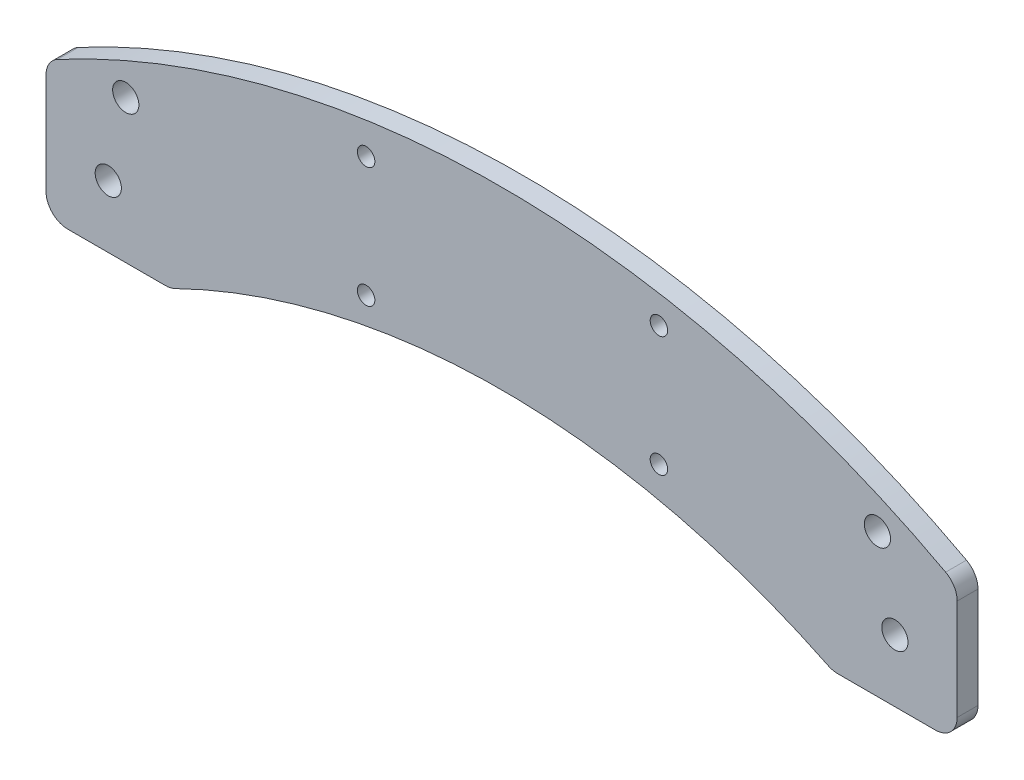
ISO-10303-21;
HEADER;
FILE_DESCRIPTION(('STEP AP214'),'2;1');
FILE_NAME('part.step','',(''),(''),'','','');
FILE_SCHEMA(('AUTOMOTIVE_DESIGN { 1 0 10303 214 1 1 1 1 }'));
ENDSEC;
DATA;
#1=APPLICATION_CONTEXT('core data for automotive mechanical design processes');
#2=APPLICATION_PROTOCOL_DEFINITION('international standard','automotive_design',2000,#1);
#3=PRODUCT_CONTEXT('',#1,'mechanical');
#4=PRODUCT('Part','Part','',(#3));
#5=PRODUCT_RELATED_PRODUCT_CATEGORY('part','',(#4));
#6=PRODUCT_DEFINITION_FORMATION('','',#4);
#7=PRODUCT_DEFINITION_CONTEXT('part definition',#1,'design');
#8=PRODUCT_DEFINITION('design','',#6,#7);
#9=PRODUCT_DEFINITION_SHAPE('','',#8);
#10=(LENGTH_UNIT() NAMED_UNIT(*) SI_UNIT(.MILLI.,.METRE.));
#11=(NAMED_UNIT(*) PLANE_ANGLE_UNIT() SI_UNIT($,.RADIAN.));
#12=(NAMED_UNIT(*) SI_UNIT($,.STERADIAN.) SOLID_ANGLE_UNIT());
#13=UNCERTAINTY_MEASURE_WITH_UNIT(LENGTH_MEASURE(1.E-05),#10,'distance_accuracy_value','');
#14=(GEOMETRIC_REPRESENTATION_CONTEXT(3) GLOBAL_UNCERTAINTY_ASSIGNED_CONTEXT((#13)) GLOBAL_UNIT_ASSIGNED_CONTEXT((#10,
#11,#12)) REPRESENTATION_CONTEXT('',''));
#15=CARTESIAN_POINT('',(0.,0.,0.));
#16=DIRECTION('',(0.,0.,1.));
#17=DIRECTION('',(1.,0.,0.));
#18=AXIS2_PLACEMENT_3D('',#15,#16,#17);
#19=CARTESIAN_POINT('',(-9.24999999999994,13.8160355116518,4.7625));
#20=DIRECTION('',(0.,0.,-1.));
#21=DIRECTION('',(-1.,0.,0.));
#22=AXIS2_PLACEMENT_3D('',#19,#20,#21);
#23=PLANE('',#22);
#24=CARTESIAN_POINT('',(4.00000000000005,18.5,4.7625));
#25=DIRECTION('',(0.,0.,1.));
#26=DIRECTION('',(1.,0.,0.));
#27=AXIS2_PLACEMENT_3D('',#24,#25,#26);
#28=CIRCLE('',#27,3.00000000000224);
#29=CARTESIAN_POINT('',(7.00000000000229,18.5,4.7625));
#30=VERTEX_POINT('',#29);
#31=EDGE_CURVE('E308',#30,#30,#28,.T.);
#32=ORIENTED_EDGE('',*,*,#31,.F.);
#33=EDGE_LOOP('',(#32));
#34=FACE_BOUND('',#33,.T.);
#35=CARTESIAN_POINT('',(180.,0.,4.7625));
#36=DIRECTION('',(0.,0.,1.));
#37=DIRECTION('',(1.,0.,0.));
#38=AXIS2_PLACEMENT_3D('',#35,#36,#37);
#39=CIRCLE('',#38,2.99999999999999);
#40=CARTESIAN_POINT('',(183.,0.,4.7625));
#41=VERTEX_POINT('',#40);
#42=EDGE_CURVE('E320',#41,#41,#39,.T.);
#43=ORIENTED_EDGE('',*,*,#42,.F.);
#44=EDGE_LOOP('',(#43));
#45=FACE_BOUND('',#44,.T.);
#46=CARTESIAN_POINT('',(125.999999999998,34.2904968261802,4.7625));
#47=DIRECTION('',(0.,0.,1.));
#48=DIRECTION('',(1.,0.,0.));
#49=AXIS2_PLACEMENT_3D('',#46,#47,#48);
#50=CIRCLE('',#49,2.);
#51=CARTESIAN_POINT('',(127.999999999998,34.2904968261802,4.7625));
#52=VERTEX_POINT('',#51);
#53=EDGE_CURVE('E332',#52,#52,#50,.T.);
#54=ORIENTED_EDGE('',*,*,#53,.F.);
#55=EDGE_LOOP('',(#54));
#56=FACE_BOUND('',#55,.T.);
#57=CARTESIAN_POINT('',(58.9999999999978,34.2904968261758,4.7625));
#58=DIRECTION('',(0.,0.,1.));
#59=DIRECTION('',(1.,0.,0.));
#60=AXIS2_PLACEMENT_3D('',#57,#58,#59);
#61=CIRCLE('',#60,1.99999999999999);
#62=CARTESIAN_POINT('',(60.9999999999977,34.2904968261758,4.7625));
#63=VERTEX_POINT('',#62);
#64=EDGE_CURVE('E158',#63,#63,#61,.T.);
#65=ORIENTED_EDGE('',*,*,#64,.F.);
#66=EDGE_LOOP('',(#65));
#67=FACE_BOUND('',#66,.T.);
#68=CARTESIAN_POINT('',(-9.24999999999994,13.8160355116518,4.7625));
#69=DIRECTION('',(0.,0.,1.));
#70=DIRECTION('',(-1.,0.,0.));
#71=AXIS2_PLACEMENT_3D('',#68,#69,#70);
#72=CIRCLE('',#71,5.);
#73=CARTESIAN_POINT('',(-11.6130952380952,18.2223696905007,4.7625));
#74=VERTEX_POINT('',#73);
#75=CARTESIAN_POINT('',(-14.2499999999999,13.8160355116518,4.7625));
#76=VERTEX_POINT('',#75);
#77=EDGE_CURVE('E177',#74,#76,#72,.T.);
#78=ORIENTED_EDGE('',*,*,#77,.T.);
#79=DIRECTION('',(1.20782173469353E-13,-1.,0.));
#80=VECTOR('',#79,1.);
#81=CARTESIAN_POINT('',(-14.2499999999972,-9.25000000000138,4.7625));
#82=LINE('',#81,#80);
#83=CARTESIAN_POINT('',(-14.2499999999972,-9.25000000000138,4.7625));
#84=VERTEX_POINT('',#83);
#85=EDGE_CURVE('E105',#76,#84,#82,.T.);
#86=ORIENTED_EDGE('',*,*,#85,.T.);
#87=CARTESIAN_POINT('',(-9.24999999999715,-9.25000000000141,4.7625));
#88=DIRECTION('',(0.,0.,1.));
#89=DIRECTION('',(1.,0.,0.));
#90=AXIS2_PLACEMENT_3D('',#87,#88,#89);
#91=CIRCLE('',#90,5.);
#92=CARTESIAN_POINT('',(-9.24999999999712,-14.2500000000014,4.7625));
#93=VERTEX_POINT('',#92);
#94=EDGE_CURVE('E204',#84,#93,#91,.T.);
#95=ORIENTED_EDGE('',*,*,#94,.T.);
#96=DIRECTION('',(1.,0.,0.));
#97=VECTOR('',#96,1.);
#98=CARTESIAN_POINT('',(13.0834357599211,-14.25,4.7625));
#99=LINE('',#98,#97);
#100=CARTESIAN_POINT('',(13.0834357599211,-14.25,4.7625));
#101=VERTEX_POINT('',#100);
#102=EDGE_CURVE('E223',#93,#101,#99,.T.);
#103=ORIENTED_EDGE('',*,*,#102,.T.);
#104=CARTESIAN_POINT('',(13.0834357599211,-9.24999999999995,4.7625));
#105=DIRECTION('',(0.,0.,1.));
#106=DIRECTION('',(-1.,0.,0.));
#107=AXIS2_PLACEMENT_3D('',#104,#105,#106);
#108=CIRCLE('',#107,4.99999999999999);
#109=CARTESIAN_POINT('',(15.2810518810662,-13.7411561300051,4.7625));
#110=VERTEX_POINT('',#109);
#111=EDGE_CURVE('E220',#101,#110,#108,.T.);
#112=ORIENTED_EDGE('',*,*,#111,.T.);
#113=CARTESIAN_POINT('',(90.0000000000002,-166.440464550181,4.7625));
#114=DIRECTION('',(0.,0.,-1.));
#115=DIRECTION('',(1.,0.,0.));
#116=AXIS2_PLACEMENT_3D('',#113,#114,#115);
#117=CIRCLE('',#116,170.);
#118=CARTESIAN_POINT('',(164.718948118934,-13.741156130005,4.7625));
#119=VERTEX_POINT('',#118);
#120=EDGE_CURVE('E222',#110,#119,#117,.T.);
#121=ORIENTED_EDGE('',*,*,#120,.T.);
#122=CARTESIAN_POINT('',(166.916564240079,-9.24999999999981,4.7625));
#123=DIRECTION('',(0.,0.,1.));
#124=DIRECTION('',(-1.,0.,0.));
#125=AXIS2_PLACEMENT_3D('',#122,#123,#124);
#126=CIRCLE('',#125,5.00000000000001);
#127=CARTESIAN_POINT('',(166.916564240079,-14.2499999999998,4.7625));
#128=VERTEX_POINT('',#127);
#129=EDGE_CURVE('E225',#119,#128,#126,.T.);
#130=ORIENTED_EDGE('',*,*,#129,.T.);
#131=DIRECTION('',(1.,0.,0.));
#132=VECTOR('',#131,1.);
#133=CARTESIAN_POINT('',(189.25,-14.25,4.7625));
#134=LINE('',#133,#132);
#135=CARTESIAN_POINT('',(189.25,-14.25,4.7625));
#136=VERTEX_POINT('',#135);
#137=EDGE_CURVE('E231',#128,#136,#134,.T.);
#138=ORIENTED_EDGE('',*,*,#137,.T.);
#139=CARTESIAN_POINT('',(189.25,-9.24999999999999,4.7625));
#140=DIRECTION('',(0.,0.,1.));
#141=DIRECTION('',(-1.,0.,0.));
#142=AXIS2_PLACEMENT_3D('',#139,#140,#141);
#143=CIRCLE('',#142,5.);
#144=CARTESIAN_POINT('',(194.25,-9.24999999999996,4.7625));
#145=VERTEX_POINT('',#144);
#146=EDGE_CURVE('E136',#136,#145,#143,.T.);
#147=ORIENTED_EDGE('',*,*,#146,.T.);
#148=DIRECTION('',(0.,1.,0.));
#149=VECTOR('',#148,1.);
#150=CARTESIAN_POINT('',(194.25,13.816035511652,4.7625));
#151=LINE('',#150,#149);
#152=CARTESIAN_POINT('',(194.25,13.816035511652,4.7625));
#153=VERTEX_POINT('',#152);
#154=EDGE_CURVE('E130',#145,#153,#151,.T.);
#155=ORIENTED_EDGE('',*,*,#154,.T.);
#156=CARTESIAN_POINT('',(189.25,13.816035511652,4.7625));
#157=DIRECTION('',(0.,0.,1.));
#158=DIRECTION('',(-1.,0.,0.));
#159=AXIS2_PLACEMENT_3D('',#156,#157,#158);
#160=CIRCLE('',#159,4.99999999999999);
#161=CARTESIAN_POINT('',(191.613095238095,18.2223696905009,4.7625));
#162=VERTEX_POINT('',#161);
#163=EDGE_CURVE('E134',#153,#162,#160,.T.);
#164=ORIENTED_EDGE('',*,*,#163,.T.);
#165=CARTESIAN_POINT('',(90.0000000000002,-171.25,4.7625));
#166=DIRECTION('',(0.,0.,1.));
#167=DIRECTION('',(-1.,0.,0.));
#168=AXIS2_PLACEMENT_3D('',#165,#166,#167);
#169=CIRCLE('',#168,215.);
#170=EDGE_CURVE('E50',#162,#74,#169,.T.);
#171=ORIENTED_EDGE('',*,*,#170,.T.);
#172=EDGE_LOOP('',(#78,#86,#95,#103,#112,#121,#130,#138,#147,#155,#164,#171));
#173=FACE_BOUND('',#172,.T.);
#174=CARTESIAN_POINT('',(58.9999999999996,6.79049682617575,4.7625));
#175=DIRECTION('',(0.,0.,1.));
#176=DIRECTION('',(1.,0.,0.));
#177=AXIS2_PLACEMENT_3D('',#174,#175,#176);
#178=CIRCLE('',#177,1.99999999999999);
#179=CARTESIAN_POINT('',(60.9999999999996,6.79049682617575,4.7625));
#180=VERTEX_POINT('',#179);
#181=EDGE_CURVE('E338',#180,#180,#178,.T.);
#182=ORIENTED_EDGE('',*,*,#181,.F.);
#183=EDGE_LOOP('',(#182));
#184=FACE_BOUND('',#183,.T.);
#185=CARTESIAN_POINT('',(126.,6.79049682618024,4.7625));
#186=DIRECTION('',(0.,0.,1.));
#187=DIRECTION('',(1.,0.,0.));
#188=AXIS2_PLACEMENT_3D('',#185,#186,#187);
#189=CIRCLE('',#188,2.);
#190=CARTESIAN_POINT('',(128.,6.79049682618024,4.7625));
#191=VERTEX_POINT('',#190);
#192=EDGE_CURVE('E326',#191,#191,#189,.T.);
#193=ORIENTED_EDGE('',*,*,#192,.F.);
#194=EDGE_LOOP('',(#193));
#195=FACE_BOUND('',#194,.T.);
#196=CARTESIAN_POINT('',(0.,0.,4.7625));
#197=DIRECTION('',(0.,0.,1.));
#198=DIRECTION('',(1.,0.,0.));
#199=AXIS2_PLACEMENT_3D('',#196,#197,#198);
#200=CIRCLE('',#199,3.);
#201=CARTESIAN_POINT('',(3.,0.,4.7625));
#202=VERTEX_POINT('',#201);
#203=EDGE_CURVE('E314',#202,#202,#200,.T.);
#204=ORIENTED_EDGE('',*,*,#203,.F.);
#205=EDGE_LOOP('',(#204));
#206=FACE_BOUND('',#205,.T.);
#207=CARTESIAN_POINT('',(176.,18.5000000000002,4.7625));
#208=DIRECTION('',(0.,0.,1.));
#209=DIRECTION('',(1.,0.,0.));
#210=AXIS2_PLACEMENT_3D('',#207,#208,#209);
#211=CIRCLE('',#210,2.99999999999999);
#212=CARTESIAN_POINT('',(179.,18.5000000000002,4.7625));
#213=VERTEX_POINT('',#212);
#214=EDGE_CURVE('E299',#213,#213,#211,.T.);
#215=ORIENTED_EDGE('',*,*,#214,.F.);
#216=EDGE_LOOP('',(#215));
#217=FACE_BOUND('',#216,.T.);
#218=ADVANCED_FACE('F33',(#34,#45,#56,#67,#173,#184,#195,#206,#217),#23,.F.);
#219=CARTESIAN_POINT('',(-9.24999999999994,13.8160355116518,0.));
#220=DIRECTION('',(0.,0.,-1.));
#221=DIRECTION('',(-1.,0.,0.));
#222=AXIS2_PLACEMENT_3D('',#219,#220,#221);
#223=PLANE('',#222);
#224=CARTESIAN_POINT('',(4.00000000000005,18.5,0.));
#225=DIRECTION('',(0.,0.,1.));
#226=DIRECTION('',(1.,0.,0.));
#227=AXIS2_PLACEMENT_3D('',#224,#225,#226);
#228=CIRCLE('',#227,3.00000000000224);
#229=CARTESIAN_POINT('',(7.00000000000229,18.5,0.));
#230=VERTEX_POINT('',#229);
#231=EDGE_CURVE('E305',#230,#230,#228,.T.);
#232=ORIENTED_EDGE('',*,*,#231,.T.);
#233=EDGE_LOOP('',(#232));
#234=FACE_BOUND('',#233,.T.);
#235=CARTESIAN_POINT('',(180.,0.,0.));
#236=DIRECTION('',(0.,0.,1.));
#237=DIRECTION('',(1.,0.,0.));
#238=AXIS2_PLACEMENT_3D('',#235,#236,#237);
#239=CIRCLE('',#238,2.99999999999999);
#240=CARTESIAN_POINT('',(183.,0.,0.));
#241=VERTEX_POINT('',#240);
#242=EDGE_CURVE('E317',#241,#241,#239,.T.);
#243=ORIENTED_EDGE('',*,*,#242,.T.);
#244=EDGE_LOOP('',(#243));
#245=FACE_BOUND('',#244,.T.);
#246=CARTESIAN_POINT('',(125.999999999998,34.2904968261802,0.));
#247=DIRECTION('',(0.,0.,1.));
#248=DIRECTION('',(1.,0.,0.));
#249=AXIS2_PLACEMENT_3D('',#246,#247,#248);
#250=CIRCLE('',#249,2.);
#251=CARTESIAN_POINT('',(127.999999999998,34.2904968261802,0.));
#252=VERTEX_POINT('',#251);
#253=EDGE_CURVE('E329',#252,#252,#250,.T.);
#254=ORIENTED_EDGE('',*,*,#253,.T.);
#255=EDGE_LOOP('',(#254));
#256=FACE_BOUND('',#255,.T.);
#257=CARTESIAN_POINT('',(58.9999999999978,34.2904968261758,0.));
#258=DIRECTION('',(0.,0.,1.));
#259=DIRECTION('',(1.,0.,0.));
#260=AXIS2_PLACEMENT_3D('',#257,#258,#259);
#261=CIRCLE('',#260,1.99999999999999);
#262=CARTESIAN_POINT('',(60.9999999999977,34.2904968261758,0.));
#263=VERTEX_POINT('',#262);
#264=EDGE_CURVE('E341',#263,#263,#261,.T.);
#265=ORIENTED_EDGE('',*,*,#264,.T.);
#266=EDGE_LOOP('',(#265));
#267=FACE_BOUND('',#266,.T.);
#268=CARTESIAN_POINT('',(-9.24999999999994,13.8160355116518,0.));
#269=DIRECTION('',(0.,0.,1.));
#270=DIRECTION('',(-1.,0.,0.));
#271=AXIS2_PLACEMENT_3D('',#268,#269,#270);
#272=CIRCLE('',#271,5.);
#273=CARTESIAN_POINT('',(-11.6130952380952,18.2223696905007,0.));
#274=VERTEX_POINT('',#273);
#275=CARTESIAN_POINT('',(-14.2499999999999,13.8160355116518,0.));
#276=VERTEX_POINT('',#275);
#277=EDGE_CURVE('E154',#274,#276,#272,.T.);
#278=ORIENTED_EDGE('',*,*,#277,.F.);
#279=CARTESIAN_POINT('',(90.0000000000002,-171.25,0.));
#280=DIRECTION('',(0.,0.,1.));
#281=DIRECTION('',(-1.,0.,0.));
#282=AXIS2_PLACEMENT_3D('',#279,#280,#281);
#283=CIRCLE('',#282,215.);
#284=CARTESIAN_POINT('',(191.613095238095,18.2223696905009,0.));
#285=VERTEX_POINT('',#284);
#286=EDGE_CURVE('E97',#285,#274,#283,.T.);
#287=ORIENTED_EDGE('',*,*,#286,.F.);
#288=CARTESIAN_POINT('',(189.25,13.816035511652,0.));
#289=DIRECTION('',(0.,0.,1.));
#290=DIRECTION('',(-1.,0.,0.));
#291=AXIS2_PLACEMENT_3D('',#288,#289,#290);
#292=CIRCLE('',#291,4.99999999999999);
#293=CARTESIAN_POINT('',(194.25,13.816035511652,0.));
#294=VERTEX_POINT('',#293);
#295=EDGE_CURVE('E91',#294,#285,#292,.T.);
#296=ORIENTED_EDGE('',*,*,#295,.F.);
#297=DIRECTION('',(0.,1.,0.));
#298=VECTOR('',#297,1.);
#299=CARTESIAN_POINT('',(194.25,13.816035511652,0.));
#300=LINE('',#299,#298);
#301=CARTESIAN_POINT('',(194.25,-9.24999999999996,0.));
#302=VERTEX_POINT('',#301);
#303=EDGE_CURVE('E144',#302,#294,#300,.T.);
#304=ORIENTED_EDGE('',*,*,#303,.F.);
#305=CARTESIAN_POINT('',(189.25,-9.24999999999999,0.));
#306=DIRECTION('',(0.,0.,1.));
#307=DIRECTION('',(-1.,0.,0.));
#308=AXIS2_PLACEMENT_3D('',#305,#306,#307);
#309=CIRCLE('',#308,5.);
#310=CARTESIAN_POINT('',(189.25,-14.25,0.));
#311=VERTEX_POINT('',#310);
#312=EDGE_CURVE('E172',#311,#302,#309,.T.);
#313=ORIENTED_EDGE('',*,*,#312,.F.);
#314=DIRECTION('',(1.,0.,0.));
#315=VECTOR('',#314,1.);
#316=CARTESIAN_POINT('',(189.25,-14.25,0.));
#317=LINE('',#316,#315);
#318=CARTESIAN_POINT('',(166.916564240079,-14.2499999999998,0.));
#319=VERTEX_POINT('',#318);
#320=EDGE_CURVE('E170',#319,#311,#317,.T.);
#321=ORIENTED_EDGE('',*,*,#320,.F.);
#322=CARTESIAN_POINT('',(166.916564240079,-9.24999999999981,0.));
#323=DIRECTION('',(0.,0.,1.));
#324=DIRECTION('',(-1.,0.,0.));
#325=AXIS2_PLACEMENT_3D('',#322,#323,#324);
#326=CIRCLE('',#325,5.00000000000001);
#327=CARTESIAN_POINT('',(164.718948118934,-13.741156130005,0.));
#328=VERTEX_POINT('',#327);
#329=EDGE_CURVE('E168',#328,#319,#326,.T.);
#330=ORIENTED_EDGE('',*,*,#329,.F.);
#331=CARTESIAN_POINT('',(90.0000000000002,-166.440464550181,0.));
#332=DIRECTION('',(0.,0.,-1.));
#333=DIRECTION('',(1.,0.,0.));
#334=AXIS2_PLACEMENT_3D('',#331,#332,#333);
#335=CIRCLE('',#334,170.);
#336=CARTESIAN_POINT('',(15.2810518810662,-13.7411561300051,0.));
#337=VERTEX_POINT('',#336);
#338=EDGE_CURVE('E166',#337,#328,#335,.T.);
#339=ORIENTED_EDGE('',*,*,#338,.F.);
#340=CARTESIAN_POINT('',(13.0834357599211,-9.24999999999995,0.));
#341=DIRECTION('',(0.,0.,1.));
#342=DIRECTION('',(-1.,0.,0.));
#343=AXIS2_PLACEMENT_3D('',#340,#341,#342);
#344=CIRCLE('',#343,4.99999999999999);
#345=CARTESIAN_POINT('',(13.0834357599211,-14.25,0.));
#346=VERTEX_POINT('',#345);
#347=EDGE_CURVE('E164',#346,#337,#344,.T.);
#348=ORIENTED_EDGE('',*,*,#347,.F.);
#349=DIRECTION('',(1.,0.,0.));
#350=VECTOR('',#349,1.);
#351=CARTESIAN_POINT('',(13.0834357599211,-14.25,0.));
#352=LINE('',#351,#350);
#353=CARTESIAN_POINT('',(-9.24999999999712,-14.2500000000014,0.));
#354=VERTEX_POINT('',#353);
#355=EDGE_CURVE('E162',#354,#346,#352,.T.);
#356=ORIENTED_EDGE('',*,*,#355,.F.);
#357=CARTESIAN_POINT('',(-9.24999999999715,-9.25000000000141,0.));
#358=DIRECTION('',(0.,0.,1.));
#359=DIRECTION('',(1.,0.,0.));
#360=AXIS2_PLACEMENT_3D('',#357,#358,#359);
#361=CIRCLE('',#360,5.);
#362=CARTESIAN_POINT('',(-14.2499999999972,-9.25000000000138,0.));
#363=VERTEX_POINT('',#362);
#364=EDGE_CURVE('E160',#363,#354,#361,.T.);
#365=ORIENTED_EDGE('',*,*,#364,.F.);
#366=DIRECTION('',(1.20782173469353E-13,-1.,0.));
#367=VECTOR('',#366,1.);
#368=CARTESIAN_POINT('',(-14.2499999999972,-9.25000000000138,0.));
#369=LINE('',#368,#367);
#370=EDGE_CURVE('E157',#276,#363,#369,.T.);
#371=ORIENTED_EDGE('',*,*,#370,.F.);
#372=EDGE_LOOP('',(#278,#287,#296,#304,#313,#321,#330,#339,#348,#356,#365,#371));
#373=FACE_BOUND('',#372,.T.);
#374=CARTESIAN_POINT('',(58.9999999999996,6.79049682617575,0.));
#375=DIRECTION('',(0.,0.,1.));
#376=DIRECTION('',(1.,0.,0.));
#377=AXIS2_PLACEMENT_3D('',#374,#375,#376);
#378=CIRCLE('',#377,1.99999999999999);
#379=CARTESIAN_POINT('',(60.9999999999996,6.79049682617575,0.));
#380=VERTEX_POINT('',#379);
#381=EDGE_CURVE('E335',#380,#380,#378,.T.);
#382=ORIENTED_EDGE('',*,*,#381,.T.);
#383=EDGE_LOOP('',(#382));
#384=FACE_BOUND('',#383,.T.);
#385=CARTESIAN_POINT('',(126.,6.79049682618024,0.));
#386=DIRECTION('',(0.,0.,1.));
#387=DIRECTION('',(1.,0.,0.));
#388=AXIS2_PLACEMENT_3D('',#385,#386,#387);
#389=CIRCLE('',#388,2.);
#390=CARTESIAN_POINT('',(128.,6.79049682618024,0.));
#391=VERTEX_POINT('',#390);
#392=EDGE_CURVE('E323',#391,#391,#389,.T.);
#393=ORIENTED_EDGE('',*,*,#392,.T.);
#394=EDGE_LOOP('',(#393));
#395=FACE_BOUND('',#394,.T.);
#396=CARTESIAN_POINT('',(0.,0.,0.));
#397=DIRECTION('',(0.,0.,1.));
#398=DIRECTION('',(1.,0.,0.));
#399=AXIS2_PLACEMENT_3D('',#396,#397,#398);
#400=CIRCLE('',#399,3.);
#401=CARTESIAN_POINT('',(3.,0.,0.));
#402=VERTEX_POINT('',#401);
#403=EDGE_CURVE('E311',#402,#402,#400,.T.);
#404=ORIENTED_EDGE('',*,*,#403,.T.);
#405=EDGE_LOOP('',(#404));
#406=FACE_BOUND('',#405,.T.);
#407=CARTESIAN_POINT('',(176.,18.5000000000002,0.));
#408=DIRECTION('',(0.,0.,1.));
#409=DIRECTION('',(1.,0.,0.));
#410=AXIS2_PLACEMENT_3D('',#407,#408,#409);
#411=CIRCLE('',#410,2.99999999999999);
#412=CARTESIAN_POINT('',(179.,18.5000000000002,0.));
#413=VERTEX_POINT('',#412);
#414=EDGE_CURVE('E302',#413,#413,#411,.T.);
#415=ORIENTED_EDGE('',*,*,#414,.T.);
#416=EDGE_LOOP('',(#415));
#417=FACE_BOUND('',#416,.T.);
#418=ADVANCED_FACE('F208',(#234,#245,#256,#267,#373,#384,#395,#406,#417),#223,.T.);
#419=CARTESIAN_POINT('',(-9.24999999999994,13.8160355116518,4.7625));
#420=DIRECTION('',(0.,0.,-1.));
#421=DIRECTION('',(-1.,0.,0.));
#422=AXIS2_PLACEMENT_3D('',#419,#420,#421);
#423=CYLINDRICAL_SURFACE('',#422,5.);
#424=ORIENTED_EDGE('',*,*,#277,.T.);
#425=DIRECTION('',(0.,0.,-1.));
#426=VECTOR('',#425,1.);
#427=CARTESIAN_POINT('',(-14.2499999999999,13.8160355116518,4.7625));
#428=LINE('',#427,#426);
#429=EDGE_CURVE('E11',#76,#276,#428,.T.);
#430=ORIENTED_EDGE('',*,*,#429,.F.);
#431=ORIENTED_EDGE('',*,*,#77,.F.);
#432=DIRECTION('',(0.,0.,-1.));
#433=VECTOR('',#432,1.);
#434=CARTESIAN_POINT('',(-11.6130952380952,18.2223696905007,4.7625));
#435=LINE('',#434,#433);
#436=EDGE_CURVE('E150',#74,#274,#435,.T.);
#437=ORIENTED_EDGE('',*,*,#436,.T.);
#438=EDGE_LOOP('',(#424,#430,#431,#437));
#439=FACE_BOUND('',#438,.T.);
#440=ADVANCED_FACE('F35',(#439),#423,.T.);
#441=CARTESIAN_POINT('',(-14.2499999999972,-9.25000000000138,4.7625));
#442=DIRECTION('',(1.,1.20782173469353E-13,0.));
#443=DIRECTION('',(-1.20782173469353E-13,1.,0.));
#444=AXIS2_PLACEMENT_3D('',#441,#442,#443);
#445=PLANE('',#444);
#446=ORIENTED_EDGE('',*,*,#370,.T.);
#447=DIRECTION('',(0.,0.,-1.));
#448=VECTOR('',#447,1.);
#449=CARTESIAN_POINT('',(-14.2499999999972,-9.25000000000138,4.7625));
#450=LINE('',#449,#448);
#451=EDGE_CURVE('E42',#84,#363,#450,.T.);
#452=ORIENTED_EDGE('',*,*,#451,.F.);
#453=ORIENTED_EDGE('',*,*,#85,.F.);
#454=ORIENTED_EDGE('',*,*,#429,.T.);
#455=EDGE_LOOP('',(#446,#452,#453,#454));
#456=FACE_BOUND('',#455,.T.);
#457=ADVANCED_FACE('F486',(#456),#445,.F.);
#458=CARTESIAN_POINT('',(-9.24999999999715,-9.25000000000141,4.7625));
#459=DIRECTION('',(0.,0.,-1.));
#460=DIRECTION('',(-1.,0.,0.));
#461=AXIS2_PLACEMENT_3D('',#458,#459,#460);
#462=CYLINDRICAL_SURFACE('',#461,5.);
#463=ORIENTED_EDGE('',*,*,#364,.T.);
#464=DIRECTION('',(0.,0.,-1.));
#465=VECTOR('',#464,1.);
#466=CARTESIAN_POINT('',(-9.24999999999712,-14.2500000000014,4.7625));
#467=LINE('',#466,#465);
#468=EDGE_CURVE('E196',#93,#354,#467,.T.);
#469=ORIENTED_EDGE('',*,*,#468,.F.);
#470=ORIENTED_EDGE('',*,*,#94,.F.);
#471=ORIENTED_EDGE('',*,*,#451,.T.);
#472=EDGE_LOOP('',(#463,#469,#470,#471));
#473=FACE_BOUND('',#472,.T.);
#474=ADVANCED_FACE('F202',(#473),#462,.T.);
#475=CARTESIAN_POINT('',(13.0834357599211,-14.25,4.7625));
#476=DIRECTION('',(0.,1.,0.));
#477=DIRECTION('',(-1.,0.,0.));
#478=AXIS2_PLACEMENT_3D('',#475,#476,#477);
#479=PLANE('',#478);
#480=ORIENTED_EDGE('',*,*,#355,.T.);
#481=DIRECTION('',(0.,0.,-1.));
#482=VECTOR('',#481,1.);
#483=CARTESIAN_POINT('',(13.0834357599211,-14.25,4.7625));
#484=LINE('',#483,#482);
#485=EDGE_CURVE('E193',#101,#346,#484,.T.);
#486=ORIENTED_EDGE('',*,*,#485,.F.);
#487=ORIENTED_EDGE('',*,*,#102,.F.);
#488=ORIENTED_EDGE('',*,*,#468,.T.);
#489=EDGE_LOOP('',(#480,#486,#487,#488));
#490=FACE_BOUND('',#489,.T.);
#491=ADVANCED_FACE('F214',(#490),#479,.F.);
#492=CARTESIAN_POINT('',(13.0834357599211,-9.24999999999995,4.7625));
#493=DIRECTION('',(0.,0.,-1.));
#494=DIRECTION('',(-1.,0.,0.));
#495=AXIS2_PLACEMENT_3D('',#492,#493,#494);
#496=CYLINDRICAL_SURFACE('',#495,4.99999999999999);
#497=ORIENTED_EDGE('',*,*,#347,.T.);
#498=DIRECTION('',(0.,0.,-1.));
#499=VECTOR('',#498,1.);
#500=CARTESIAN_POINT('',(15.2810518810662,-13.7411561300051,4.7625));
#501=LINE('',#500,#499);
#502=EDGE_CURVE('E190',#110,#337,#501,.T.);
#503=ORIENTED_EDGE('',*,*,#502,.F.);
#504=ORIENTED_EDGE('',*,*,#111,.F.);
#505=ORIENTED_EDGE('',*,*,#485,.T.);
#506=EDGE_LOOP('',(#497,#503,#504,#505));
#507=FACE_BOUND('',#506,.T.);
#508=ADVANCED_FACE('F218',(#507),#496,.T.);
#509=CARTESIAN_POINT('',(90.0000000000002,-166.440464550181,4.7625));
#510=DIRECTION('',(0.,0.,-1.));
#511=DIRECTION('',(-1.,0.,0.));
#512=AXIS2_PLACEMENT_3D('',#509,#510,#511);
#513=CYLINDRICAL_SURFACE('',#512,170.);
#514=ORIENTED_EDGE('',*,*,#338,.T.);
#515=DIRECTION('',(0.,0.,-1.));
#516=VECTOR('',#515,1.);
#517=CARTESIAN_POINT('',(164.718948118934,-13.741156130005,4.7625));
#518=LINE('',#517,#516);
#519=EDGE_CURVE('E187',#119,#328,#518,.T.);
#520=ORIENTED_EDGE('',*,*,#519,.F.);
#521=ORIENTED_EDGE('',*,*,#120,.F.);
#522=ORIENTED_EDGE('',*,*,#502,.T.);
#523=EDGE_LOOP('',(#514,#520,#521,#522));
#524=FACE_BOUND('',#523,.T.);
#525=ADVANCED_FACE('F451',(#524),#513,.F.);
#526=CARTESIAN_POINT('',(166.916564240079,-9.24999999999981,4.7625));
#527=DIRECTION('',(0.,0.,-1.));
#528=DIRECTION('',(-1.,0.,0.));
#529=AXIS2_PLACEMENT_3D('',#526,#527,#528);
#530=CYLINDRICAL_SURFACE('',#529,5.00000000000001);
#531=ORIENTED_EDGE('',*,*,#329,.T.);
#532=DIRECTION('',(0.,0.,-1.));
#533=VECTOR('',#532,1.);
#534=CARTESIAN_POINT('',(166.916564240079,-14.2499999999998,4.7625));
#535=LINE('',#534,#533);
#536=EDGE_CURVE('E184',#128,#319,#535,.T.);
#537=ORIENTED_EDGE('',*,*,#536,.F.);
#538=ORIENTED_EDGE('',*,*,#129,.F.);
#539=ORIENTED_EDGE('',*,*,#519,.T.);
#540=EDGE_LOOP('',(#531,#537,#538,#539));
#541=FACE_BOUND('',#540,.T.);
#542=ADVANCED_FACE('F442',(#541),#530,.T.);
#543=CARTESIAN_POINT('',(189.25,-14.25,4.7625));
#544=DIRECTION('',(0.,1.,0.));
#545=DIRECTION('',(-1.,0.,0.));
#546=AXIS2_PLACEMENT_3D('',#543,#544,#545);
#547=PLANE('',#546);
#548=ORIENTED_EDGE('',*,*,#320,.T.);
#549=DIRECTION('',(0.,0.,-1.));
#550=VECTOR('',#549,1.);
#551=CARTESIAN_POINT('',(189.25,-14.25,4.7625));
#552=LINE('',#551,#550);
#553=EDGE_CURVE('E181',#136,#311,#552,.T.);
#554=ORIENTED_EDGE('',*,*,#553,.F.);
#555=ORIENTED_EDGE('',*,*,#137,.F.);
#556=ORIENTED_EDGE('',*,*,#536,.T.);
#557=EDGE_LOOP('',(#548,#554,#555,#556));
#558=FACE_BOUND('',#557,.T.);
#559=ADVANCED_FACE('F237',(#558),#547,.F.);
#560=CARTESIAN_POINT('',(189.25,-9.24999999999999,4.7625));
#561=DIRECTION('',(0.,0.,-1.));
#562=DIRECTION('',(-1.,0.,0.));
#563=AXIS2_PLACEMENT_3D('',#560,#561,#562);
#564=CYLINDRICAL_SURFACE('',#563,5.);
#565=ORIENTED_EDGE('',*,*,#312,.T.);
#566=DIRECTION('',(0.,0.,-1.));
#567=VECTOR('',#566,1.);
#568=CARTESIAN_POINT('',(194.25,-9.24999999999996,4.7625));
#569=LINE('',#568,#567);
#570=EDGE_CURVE('E145',#145,#302,#569,.T.);
#571=ORIENTED_EDGE('',*,*,#570,.F.);
#572=ORIENTED_EDGE('',*,*,#146,.F.);
#573=ORIENTED_EDGE('',*,*,#553,.T.);
#574=EDGE_LOOP('',(#565,#571,#572,#573));
#575=FACE_BOUND('',#574,.T.);
#576=ADVANCED_FACE('F241',(#575),#564,.T.);
#577=CARTESIAN_POINT('',(194.25,13.816035511652,4.7625));
#578=DIRECTION('',(-1.,0.,0.));
#579=DIRECTION('',(0.,-1.,0.));
#580=AXIS2_PLACEMENT_3D('',#577,#578,#579);
#581=PLANE('',#580);
#582=ORIENTED_EDGE('',*,*,#303,.T.);
#583=DIRECTION('',(0.,0.,-1.));
#584=VECTOR('',#583,1.);
#585=CARTESIAN_POINT('',(194.25,13.816035511652,4.7625));
#586=LINE('',#585,#584);
#587=EDGE_CURVE('E141',#153,#294,#586,.T.);
#588=ORIENTED_EDGE('',*,*,#587,.F.);
#589=ORIENTED_EDGE('',*,*,#154,.F.);
#590=ORIENTED_EDGE('',*,*,#570,.T.);
#591=EDGE_LOOP('',(#582,#588,#589,#590));
#592=FACE_BOUND('',#591,.T.);
#593=ADVANCED_FACE('F142',(#592),#581,.F.);
#594=CARTESIAN_POINT('',(189.25,13.816035511652,4.7625));
#595=DIRECTION('',(0.,0.,-1.));
#596=DIRECTION('',(-1.,0.,0.));
#597=AXIS2_PLACEMENT_3D('',#594,#595,#596);
#598=CYLINDRICAL_SURFACE('',#597,4.99999999999999);
#599=ORIENTED_EDGE('',*,*,#295,.T.);
#600=DIRECTION('',(0.,0.,-1.));
#601=VECTOR('',#600,1.);
#602=CARTESIAN_POINT('',(191.613095238095,18.2223696905009,4.7625));
#603=LINE('',#602,#601);
#604=EDGE_CURVE('E146',#162,#285,#603,.T.);
#605=ORIENTED_EDGE('',*,*,#604,.F.);
#606=ORIENTED_EDGE('',*,*,#163,.F.);
#607=ORIENTED_EDGE('',*,*,#587,.T.);
#608=EDGE_LOOP('',(#599,#605,#606,#607));
#609=FACE_BOUND('',#608,.T.);
#610=ADVANCED_FACE('F148',(#609),#598,.T.);
#611=CARTESIAN_POINT('',(90.0000000000002,-171.25,4.7625));
#612=DIRECTION('',(0.,0.,-1.));
#613=DIRECTION('',(-1.,0.,0.));
#614=AXIS2_PLACEMENT_3D('',#611,#612,#613);
#615=CYLINDRICAL_SURFACE('',#614,215.);
#616=ORIENTED_EDGE('',*,*,#286,.T.);
#617=ORIENTED_EDGE('',*,*,#436,.F.);
#618=ORIENTED_EDGE('',*,*,#170,.F.);
#619=ORIENTED_EDGE('',*,*,#604,.T.);
#620=EDGE_LOOP('',(#616,#617,#618,#619));
#621=FACE_BOUND('',#620,.T.);
#622=ADVANCED_FACE('F245',(#621),#615,.T.);
#623=CARTESIAN_POINT('',(58.9999999999978,34.2904968261758,4.7625));
#624=DIRECTION('',(0.,0.,-1.));
#625=DIRECTION('',(-1.,0.,0.));
#626=AXIS2_PLACEMENT_3D('',#623,#624,#625);
#627=CYLINDRICAL_SURFACE('',#626,1.99999999999999);
#628=ORIENTED_EDGE('',*,*,#64,.T.);
#629=EDGE_LOOP('',(#628));
#630=FACE_BOUND('',#629,.T.);
#631=ORIENTED_EDGE('',*,*,#264,.F.);
#632=EDGE_LOOP('',(#631));
#633=FACE_BOUND('',#632,.T.);
#634=ADVANCED_FACE('F247',(#630,#633),#627,.F.);
#635=CARTESIAN_POINT('',(58.9999999999996,6.79049682617575,4.7625));
#636=DIRECTION('',(0.,0.,-1.));
#637=DIRECTION('',(-1.,0.,0.));
#638=AXIS2_PLACEMENT_3D('',#635,#636,#637);
#639=CYLINDRICAL_SURFACE('',#638,1.99999999999999);
#640=ORIENTED_EDGE('',*,*,#181,.T.);
#641=EDGE_LOOP('',(#640));
#642=FACE_BOUND('',#641,.T.);
#643=ORIENTED_EDGE('',*,*,#381,.F.);
#644=EDGE_LOOP('',(#643));
#645=FACE_BOUND('',#644,.T.);
#646=ADVANCED_FACE('F253',(#642,#645),#639,.F.);
#647=CARTESIAN_POINT('',(125.999999999998,34.2904968261802,4.7625));
#648=DIRECTION('',(0.,0.,-1.));
#649=DIRECTION('',(-1.,0.,0.));
#650=AXIS2_PLACEMENT_3D('',#647,#648,#649);
#651=CYLINDRICAL_SURFACE('',#650,2.);
#652=ORIENTED_EDGE('',*,*,#53,.T.);
#653=EDGE_LOOP('',(#652));
#654=FACE_BOUND('',#653,.T.);
#655=ORIENTED_EDGE('',*,*,#253,.F.);
#656=EDGE_LOOP('',(#655));
#657=FACE_BOUND('',#656,.T.);
#658=ADVANCED_FACE('F270',(#654,#657),#651,.F.);
#659=CARTESIAN_POINT('',(126.,6.79049682618024,4.7625));
#660=DIRECTION('',(0.,0.,-1.));
#661=DIRECTION('',(-1.,0.,0.));
#662=AXIS2_PLACEMENT_3D('',#659,#660,#661);
#663=CYLINDRICAL_SURFACE('',#662,2.);
#664=ORIENTED_EDGE('',*,*,#192,.T.);
#665=EDGE_LOOP('',(#664));
#666=FACE_BOUND('',#665,.T.);
#667=ORIENTED_EDGE('',*,*,#392,.F.);
#668=EDGE_LOOP('',(#667));
#669=FACE_BOUND('',#668,.T.);
#670=ADVANCED_FACE('F274',(#666,#669),#663,.F.);
#671=CARTESIAN_POINT('',(180.,0.,4.7625));
#672=DIRECTION('',(0.,0.,-1.));
#673=DIRECTION('',(-1.,0.,0.));
#674=AXIS2_PLACEMENT_3D('',#671,#672,#673);
#675=CYLINDRICAL_SURFACE('',#674,2.99999999999999);
#676=ORIENTED_EDGE('',*,*,#42,.T.);
#677=EDGE_LOOP('',(#676));
#678=FACE_BOUND('',#677,.T.);
#679=ORIENTED_EDGE('',*,*,#242,.F.);
#680=EDGE_LOOP('',(#679));
#681=FACE_BOUND('',#680,.T.);
#682=ADVANCED_FACE('F278',(#678,#681),#675,.F.);
#683=CARTESIAN_POINT('',(0.,0.,4.7625));
#684=DIRECTION('',(0.,0.,-1.));
#685=DIRECTION('',(-1.,0.,0.));
#686=AXIS2_PLACEMENT_3D('',#683,#684,#685);
#687=CYLINDRICAL_SURFACE('',#686,3.);
#688=ORIENTED_EDGE('',*,*,#203,.T.);
#689=EDGE_LOOP('',(#688));
#690=FACE_BOUND('',#689,.T.);
#691=ORIENTED_EDGE('',*,*,#403,.F.);
#692=EDGE_LOOP('',(#691));
#693=FACE_BOUND('',#692,.T.);
#694=ADVANCED_FACE('F282',(#690,#693),#687,.F.);
#695=CARTESIAN_POINT('',(4.00000000000005,18.5,4.7625));
#696=DIRECTION('',(0.,0.,-1.));
#697=DIRECTION('',(-1.,0.,0.));
#698=AXIS2_PLACEMENT_3D('',#695,#696,#697);
#699=CYLINDRICAL_SURFACE('',#698,3.00000000000224);
#700=ORIENTED_EDGE('',*,*,#31,.T.);
#701=EDGE_LOOP('',(#700));
#702=FACE_BOUND('',#701,.T.);
#703=ORIENTED_EDGE('',*,*,#231,.F.);
#704=EDGE_LOOP('',(#703));
#705=FACE_BOUND('',#704,.T.);
#706=ADVANCED_FACE('F286',(#702,#705),#699,.F.);
#707=CARTESIAN_POINT('',(176.,18.5000000000002,4.7625));
#708=DIRECTION('',(0.,0.,-1.));
#709=DIRECTION('',(-1.,0.,0.));
#710=AXIS2_PLACEMENT_3D('',#707,#708,#709);
#711=CYLINDRICAL_SURFACE('',#710,2.99999999999999);
#712=ORIENTED_EDGE('',*,*,#214,.T.);
#713=EDGE_LOOP('',(#712));
#714=FACE_BOUND('',#713,.T.);
#715=ORIENTED_EDGE('',*,*,#414,.F.);
#716=EDGE_LOOP('',(#715));
#717=FACE_BOUND('',#716,.T.);
#718=ADVANCED_FACE('F290',(#714,#717),#711,.F.);
#719=CLOSED_SHELL('',(#218,#418,#440,#457,#474,#491,#508,#525,#542,#559,#576,#593,#610,#622,
#634,#646,#658,#670,#682,#694,#706,#718));
#720=MANIFOLD_SOLID_BREP('B2',#719);
#721=ADVANCED_BREP_SHAPE_REPRESENTATION('',(#18,#720),#14);
#722=SHAPE_DEFINITION_REPRESENTATION(#9,#721);
ENDSEC;
END-ISO-10303-21;
